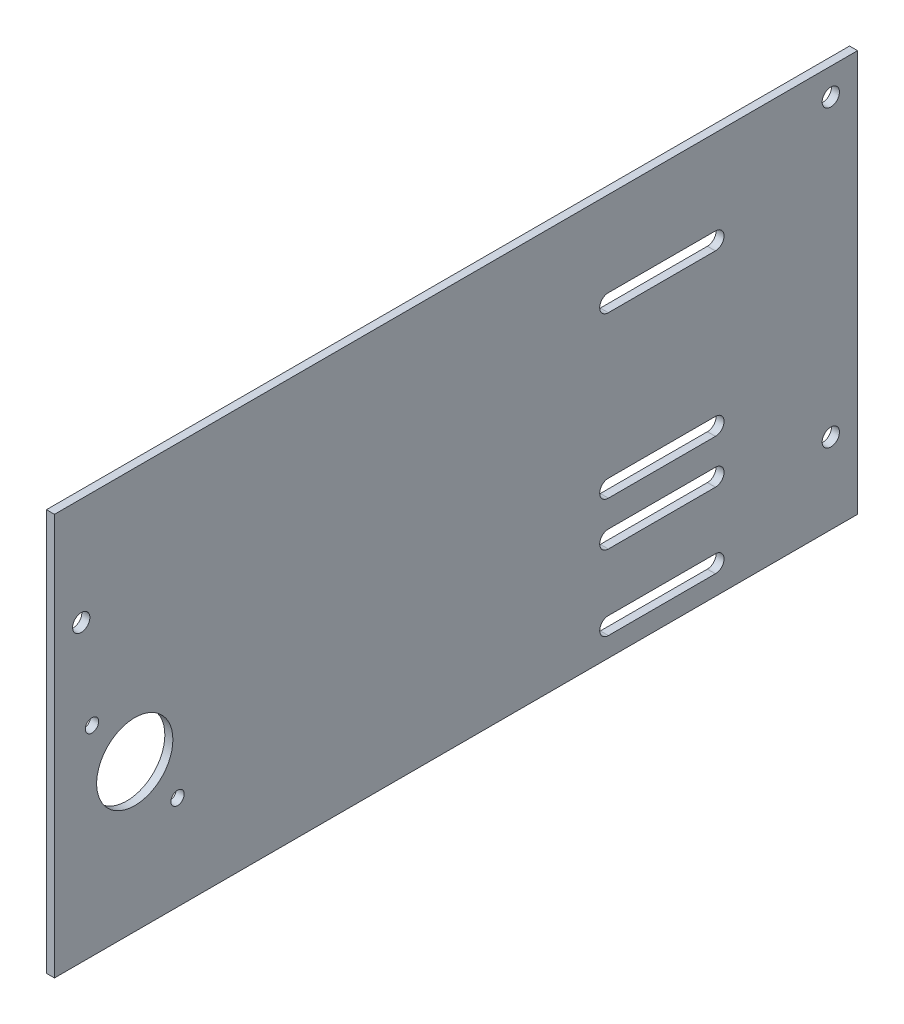
ISO-10303-21;
HEADER;
FILE_DESCRIPTION(('STEP AP214'),'2;1');
FILE_NAME('part.step','',(''),(''),'','','');
FILE_SCHEMA(('AUTOMOTIVE_DESIGN { 1 0 10303 214 1 1 1 1 }'));
ENDSEC;
DATA;
#1=APPLICATION_CONTEXT('core data for automotive mechanical design processes');
#2=APPLICATION_PROTOCOL_DEFINITION('international standard','automotive_design',2000,#1);
#3=PRODUCT_CONTEXT('',#1,'mechanical');
#4=PRODUCT('Part','Part','',(#3));
#5=PRODUCT_RELATED_PRODUCT_CATEGORY('part','',(#4));
#6=PRODUCT_DEFINITION_FORMATION('','',#4);
#7=PRODUCT_DEFINITION_CONTEXT('part definition',#1,'design');
#8=PRODUCT_DEFINITION('design','',#6,#7);
#9=PRODUCT_DEFINITION_SHAPE('','',#8);
#10=(LENGTH_UNIT() NAMED_UNIT(*) SI_UNIT(.MILLI.,.METRE.));
#11=(NAMED_UNIT(*) PLANE_ANGLE_UNIT() SI_UNIT($,.RADIAN.));
#12=(NAMED_UNIT(*) SI_UNIT($,.STERADIAN.) SOLID_ANGLE_UNIT());
#13=UNCERTAINTY_MEASURE_WITH_UNIT(LENGTH_MEASURE(1.E-05),#10,'distance_accuracy_value','');
#14=(GEOMETRIC_REPRESENTATION_CONTEXT(3) GLOBAL_UNCERTAINTY_ASSIGNED_CONTEXT((#13)) GLOBAL_UNIT_ASSIGNED_CONTEXT((#10,
#11,#12)) REPRESENTATION_CONTEXT('',''));
#15=CARTESIAN_POINT('',(0.,0.,0.));
#16=DIRECTION('',(0.,0.,1.));
#17=DIRECTION('',(1.,0.,0.));
#18=AXIS2_PLACEMENT_3D('',#15,#16,#17);
#19=CARTESIAN_POINT('',(3.,0.,0.));
#20=DIRECTION('',(-1.,0.,0.));
#21=DIRECTION('',(0.,0.,1.));
#22=AXIS2_PLACEMENT_3D('',#19,#20,#21);
#23=PLANE('',#22);
#24=CARTESIAN_POINT('',(3.,35.2682046198761,-45.9942568153991));
#25=DIRECTION('',(1.,0.,0.));
#26=DIRECTION('',(0.,0.,-1.));
#27=AXIS2_PLACEMENT_3D('',#24,#25,#26);
#28=CIRCLE('',#27,2.4892);
#29=CARTESIAN_POINT('',(3.,35.2682046198761,-48.4834568153991));
#30=VERTEX_POINT('',#29);
#31=EDGE_CURVE('E476',#30,#30,#28,.T.);
#32=ORIENTED_EDGE('',*,*,#31,.F.);
#33=EDGE_LOOP('',(#32));
#34=FACE_BOUND('',#33,.T.);
#35=CARTESIAN_POINT('',(3.,74.7317953801237,-14.0057431846019));
#36=DIRECTION('',(1.,0.,0.));
#37=DIRECTION('',(0.,0.,-1.));
#38=AXIS2_PLACEMENT_3D('',#35,#36,#37);
#39=CIRCLE('',#38,2.48920000000001);
#40=CARTESIAN_POINT('',(3.,74.7317953801237,-16.4949431846019));
#41=VERTEX_POINT('',#40);
#42=EDGE_CURVE('E479',#41,#41,#39,.T.);
#43=ORIENTED_EDGE('',*,*,#42,.F.);
#44=EDGE_LOOP('',(#43));
#45=FACE_BOUND('',#44,.T.);
#46=DIRECTION('',(0.,0.,1.));
#47=VECTOR('',#46,1.);
#48=CARTESIAN_POINT('',(3.,13.775,-246.901029004475));
#49=LINE('',#48,#47);
#50=CARTESIAN_POINT('',(3.,13.775,-246.901029004475));
#51=VERTEX_POINT('',#50);
#52=CARTESIAN_POINT('',(3.,13.775,-206.901029004475));
#53=VERTEX_POINT('',#52);
#54=EDGE_CURVE('E276',#51,#53,#49,.T.);
#55=ORIENTED_EDGE('',*,*,#54,.F.);
#56=CARTESIAN_POINT('',(3.,10.55,-246.901029004475));
#57=DIRECTION('',(-1.,0.,0.));
#58=DIRECTION('',(0.,0.,1.));
#59=AXIS2_PLACEMENT_3D('',#56,#57,#58);
#60=CIRCLE('',#59,3.225);
#61=CARTESIAN_POINT('',(3.,7.32499999999999,-246.901029004475));
#62=VERTEX_POINT('',#61);
#63=EDGE_CURVE('E274',#62,#51,#60,.F.);
#64=ORIENTED_EDGE('',*,*,#63,.F.);
#65=DIRECTION('',(0.,0.,-1.));
#66=VECTOR('',#65,1.);
#67=CARTESIAN_POINT('',(3.,7.32499999999999,-246.901029004475));
#68=LINE('',#67,#66);
#69=CARTESIAN_POINT('',(3.,7.325,-206.901029004475));
#70=VERTEX_POINT('',#69);
#71=EDGE_CURVE('E249',#70,#62,#68,.T.);
#72=ORIENTED_EDGE('',*,*,#71,.F.);
#73=CARTESIAN_POINT('',(3.,10.55,-206.901029004475));
#74=DIRECTION('',(-1.,0.,0.));
#75=DIRECTION('',(0.,0.,1.));
#76=AXIS2_PLACEMENT_3D('',#73,#74,#75);
#77=CIRCLE('',#76,3.225);
#78=EDGE_CURVE('E53',#53,#70,#77,.F.);
#79=ORIENTED_EDGE('',*,*,#78,.F.);
#80=EDGE_LOOP('',(#55,#64,#72,#79));
#81=FACE_BOUND('',#80,.T.);
#82=CARTESIAN_POINT('',(3.,30.,-290.));
#83=DIRECTION('',(-1.,0.,0.));
#84=DIRECTION('',(0.,0.,1.));
#85=AXIS2_PLACEMENT_3D('',#82,#83,#84);
#86=CIRCLE('',#85,3.22499999999999);
#87=CARTESIAN_POINT('',(3.,30.,-286.775));
#88=VERTEX_POINT('',#87);
#89=EDGE_CURVE('E242',#88,#88,#86,.F.);
#90=ORIENTED_EDGE('',*,*,#89,.F.);
#91=EDGE_LOOP('',(#90));
#92=FACE_BOUND('',#91,.T.);
#93=DIRECTION('',(0.,0.,-1.));
#94=VECTOR('',#93,1.);
#95=CARTESIAN_POINT('',(3.,111.77,-206.901029004475));
#96=LINE('',#95,#94);
#97=CARTESIAN_POINT('',(3.,111.77,-206.901029004475));
#98=VERTEX_POINT('',#97);
#99=CARTESIAN_POINT('',(3.,111.77,-246.901029004475));
#100=VERTEX_POINT('',#99);
#101=EDGE_CURVE('E231',#98,#100,#96,.T.);
#102=ORIENTED_EDGE('',*,*,#101,.F.);
#103=CARTESIAN_POINT('',(3.,115.,-206.901029004475));
#104=DIRECTION('',(-1.,0.,0.));
#105=DIRECTION('',(0.,0.,1.));
#106=AXIS2_PLACEMENT_3D('',#103,#104,#105);
#107=CIRCLE('',#106,3.22999999999996);
#108=CARTESIAN_POINT('',(3.,118.23,-206.901029004475));
#109=VERTEX_POINT('',#108);
#110=EDGE_CURVE('E229',#109,#98,#107,.F.);
#111=ORIENTED_EDGE('',*,*,#110,.F.);
#112=DIRECTION('',(0.,0.,1.));
#113=VECTOR('',#112,1.);
#114=CARTESIAN_POINT('',(3.,118.23,-206.901029004475));
#115=LINE('',#114,#113);
#116=CARTESIAN_POINT('',(3.,118.23,-246.901029004475));
#117=VERTEX_POINT('',#116);
#118=EDGE_CURVE('E207',#117,#109,#115,.T.);
#119=ORIENTED_EDGE('',*,*,#118,.F.);
#120=CARTESIAN_POINT('',(3.,115.,-246.901029004475));
#121=DIRECTION('',(-1.,0.,0.));
#122=DIRECTION('',(0.,0.,1.));
#123=AXIS2_PLACEMENT_3D('',#120,#121,#122);
#124=CIRCLE('',#123,3.22999999999996);
#125=EDGE_CURVE('E61',#100,#117,#124,.F.);
#126=ORIENTED_EDGE('',*,*,#125,.F.);
#127=EDGE_LOOP('',(#102,#111,#119,#126));
#128=FACE_BOUND('',#127,.T.);
#129=CARTESIAN_POINT('',(3.,140.,-290.));
#130=DIRECTION('',(-1.,0.,0.));
#131=DIRECTION('',(0.,0.,1.));
#132=AXIS2_PLACEMENT_3D('',#129,#130,#131);
#133=CIRCLE('',#132,3.22499999999999);
#134=CARTESIAN_POINT('',(3.,140.,-286.775));
#135=VERTEX_POINT('',#134);
#136=EDGE_CURVE('E238',#135,#135,#133,.F.);
#137=ORIENTED_EDGE('',*,*,#136,.F.);
#138=EDGE_LOOP('',(#137));
#139=FACE_BOUND('',#138,.T.);
#140=CARTESIAN_POINT('',(3.,110.,-10.));
#141=DIRECTION('',(-1.,0.,0.));
#142=DIRECTION('',(0.,0.,1.));
#143=AXIS2_PLACEMENT_3D('',#140,#141,#142);
#144=CIRCLE('',#143,3.225);
#145=CARTESIAN_POINT('',(3.,110.,-6.775));
#146=VERTEX_POINT('',#145);
#147=EDGE_CURVE('E205',#146,#146,#144,.F.);
#148=ORIENTED_EDGE('',*,*,#147,.F.);
#149=EDGE_LOOP('',(#148));
#150=FACE_BOUND('',#149,.T.);
#151=DIRECTION('',(0.,0.,1.));
#152=VECTOR('',#151,1.);
#153=CARTESIAN_POINT('',(3.,41.775,-246.901029004475));
#154=LINE('',#153,#152);
#155=CARTESIAN_POINT('',(3.,41.775,-246.901029004475));
#156=VERTEX_POINT('',#155);
#157=CARTESIAN_POINT('',(3.,41.775,-206.901029004475));
#158=VERTEX_POINT('',#157);
#159=EDGE_CURVE('E179',#156,#158,#154,.T.);
#160=ORIENTED_EDGE('',*,*,#159,.F.);
#161=CARTESIAN_POINT('',(3.,38.55,-246.901029004475));
#162=DIRECTION('',(-1.,0.,0.));
#163=DIRECTION('',(0.,0.,1.));
#164=AXIS2_PLACEMENT_3D('',#161,#162,#163);
#165=CIRCLE('',#164,3.22500000000001);
#166=CARTESIAN_POINT('',(3.,35.325,-246.901029004475));
#167=VERTEX_POINT('',#166);
#168=EDGE_CURVE('E188',#167,#156,#165,.F.);
#169=ORIENTED_EDGE('',*,*,#168,.F.);
#170=DIRECTION('',(0.,0.,-1.));
#171=VECTOR('',#170,1.);
#172=CARTESIAN_POINT('',(3.,35.325,-246.901029004475));
#173=LINE('',#172,#171);
#174=CARTESIAN_POINT('',(3.,35.325,-206.901029004475));
#175=VERTEX_POINT('',#174);
#176=EDGE_CURVE('E190',#175,#167,#173,.T.);
#177=ORIENTED_EDGE('',*,*,#176,.F.);
#178=CARTESIAN_POINT('',(3.,38.55,-206.901029004475));
#179=DIRECTION('',(-1.,0.,0.));
#180=DIRECTION('',(0.,0.,1.));
#181=AXIS2_PLACEMENT_3D('',#178,#179,#180);
#182=CIRCLE('',#181,3.22500000000001);
#183=EDGE_CURVE('E197',#158,#175,#182,.F.);
#184=ORIENTED_EDGE('',*,*,#183,.F.);
#185=EDGE_LOOP('',(#160,#169,#177,#184));
#186=FACE_BOUND('',#185,.T.);
#187=DIRECTION('',(0.,0.,1.));
#188=VECTOR('',#187,1.);
#189=CARTESIAN_POINT('',(3.,58.225,-246.901029004475));
#190=LINE('',#189,#188);
#191=CARTESIAN_POINT('',(3.,58.225,-246.901029004475));
#192=VERTEX_POINT('',#191);
#193=CARTESIAN_POINT('',(3.,58.225,-206.901029004475));
#194=VERTEX_POINT('',#193);
#195=EDGE_CURVE('E285',#192,#194,#190,.T.);
#196=ORIENTED_EDGE('',*,*,#195,.F.);
#197=CARTESIAN_POINT('',(3.,55.,-246.901029004475));
#198=DIRECTION('',(-1.,0.,0.));
#199=DIRECTION('',(0.,0.,1.));
#200=AXIS2_PLACEMENT_3D('',#197,#198,#199);
#201=CIRCLE('',#200,3.22500000000001);
#202=CARTESIAN_POINT('',(3.,51.775,-246.901029004475));
#203=VERTEX_POINT('',#202);
#204=EDGE_CURVE('E282',#203,#192,#201,.F.);
#205=ORIENTED_EDGE('',*,*,#204,.F.);
#206=DIRECTION('',(0.,0.,-1.));
#207=VECTOR('',#206,1.);
#208=CARTESIAN_POINT('',(3.,51.775,-246.901029004475));
#209=LINE('',#208,#207);
#210=CARTESIAN_POINT('',(3.,51.775,-206.901029004475));
#211=VERTEX_POINT('',#210);
#212=EDGE_CURVE('E305',#211,#203,#209,.T.);
#213=ORIENTED_EDGE('',*,*,#212,.F.);
#214=CARTESIAN_POINT('',(3.,55.,-206.901029004475));
#215=DIRECTION('',(-1.,0.,0.));
#216=DIRECTION('',(0.,0.,1.));
#217=AXIS2_PLACEMENT_3D('',#214,#215,#216);
#218=CIRCLE('',#217,3.225);
#219=EDGE_CURVE('E240',#194,#211,#218,.F.);
#220=ORIENTED_EDGE('',*,*,#219,.F.);
#221=EDGE_LOOP('',(#196,#205,#213,#220));
#222=FACE_BOUND('',#221,.T.);
#223=DIRECTION('',(0.,-1.,0.));
#224=VECTOR('',#223,1.);
#225=CARTESIAN_POINT('',(3.,0.,0.));
#226=LINE('',#225,#224);
#227=CARTESIAN_POINT('',(3.,150.,0.));
#228=VERTEX_POINT('',#227);
#229=CARTESIAN_POINT('',(3.,0.,0.));
#230=VERTEX_POINT('',#229);
#231=EDGE_CURVE('E319',#228,#230,#226,.T.);
#232=ORIENTED_EDGE('',*,*,#231,.T.);
#233=DIRECTION('',(0.,0.,-1.));
#234=VECTOR('',#233,1.);
#235=CARTESIAN_POINT('',(3.,0.,0.));
#236=LINE('',#235,#234);
#237=CARTESIAN_POINT('',(3.,0.,-300.));
#238=VERTEX_POINT('',#237);
#239=EDGE_CURVE('E324',#230,#238,#236,.T.);
#240=ORIENTED_EDGE('',*,*,#239,.T.);
#241=DIRECTION('',(0.,1.,0.));
#242=VECTOR('',#241,1.);
#243=CARTESIAN_POINT('',(3.,0.,-300.));
#244=LINE('',#243,#242);
#245=CARTESIAN_POINT('',(3.,150.,-300.));
#246=VERTEX_POINT('',#245);
#247=EDGE_CURVE('E323',#238,#246,#244,.T.);
#248=ORIENTED_EDGE('',*,*,#247,.T.);
#249=DIRECTION('',(0.,0.,1.));
#250=VECTOR('',#249,1.);
#251=CARTESIAN_POINT('',(3.,150.,0.));
#252=LINE('',#251,#250);
#253=EDGE_CURVE('E328',#246,#228,#252,.T.);
#254=ORIENTED_EDGE('',*,*,#253,.T.);
#255=EDGE_LOOP('',(#232,#240,#248,#254));
#256=FACE_BOUND('',#255,.T.);
#257=CARTESIAN_POINT('',(3.,55.,-30.));
#258=DIRECTION('',(1.,0.,0.));
#259=DIRECTION('',(0.,0.,-1.));
#260=AXIS2_PLACEMENT_3D('',#257,#258,#259);
#261=CIRCLE('',#260,14.235);
#262=CARTESIAN_POINT('',(3.,55.,-44.235));
#263=VERTEX_POINT('',#262);
#264=EDGE_CURVE('E315',#263,#263,#261,.T.);
#265=ORIENTED_EDGE('',*,*,#264,.F.);
#266=EDGE_LOOP('',(#265));
#267=FACE_BOUND('',#266,.T.);
#268=ADVANCED_FACE('F39',(#34,#45,#81,#92,#128,#139,#150,#186,#222,#256,#267),#23,.F.);
#269=CARTESIAN_POINT('',(0.,0.,0.));
#270=DIRECTION('',(-1.,0.,0.));
#271=DIRECTION('',(0.,0.,1.));
#272=AXIS2_PLACEMENT_3D('',#269,#270,#271);
#273=PLANE('',#272);
#274=CARTESIAN_POINT('',(0.,35.2682046198761,-45.9942568153991));
#275=DIRECTION('',(1.,0.,0.));
#276=DIRECTION('',(0.,0.,-1.));
#277=AXIS2_PLACEMENT_3D('',#274,#275,#276);
#278=CIRCLE('',#277,2.4892);
#279=CARTESIAN_POINT('',(0.,35.2682046198761,-48.4834568153991));
#280=VERTEX_POINT('',#279);
#281=EDGE_CURVE('E251',#280,#280,#278,.T.);
#282=ORIENTED_EDGE('',*,*,#281,.T.);
#283=EDGE_LOOP('',(#282));
#284=FACE_BOUND('',#283,.T.);
#285=CARTESIAN_POINT('',(0.,74.7317953801237,-14.0057431846019));
#286=DIRECTION('',(1.,0.,0.));
#287=DIRECTION('',(0.,0.,-1.));
#288=AXIS2_PLACEMENT_3D('',#285,#286,#287);
#289=CIRCLE('',#288,2.48920000000001);
#290=CARTESIAN_POINT('',(0.,74.7317953801237,-16.4949431846019));
#291=VERTEX_POINT('',#290);
#292=EDGE_CURVE('E481',#291,#291,#289,.T.);
#293=ORIENTED_EDGE('',*,*,#292,.T.);
#294=EDGE_LOOP('',(#293));
#295=FACE_BOUND('',#294,.T.);
#296=CARTESIAN_POINT('',(0.,10.55,-246.901029004475));
#297=DIRECTION('',(-1.,0.,0.));
#298=DIRECTION('',(0.,0.,1.));
#299=AXIS2_PLACEMENT_3D('',#296,#297,#298);
#300=CIRCLE('',#299,3.225);
#301=CARTESIAN_POINT('',(0.,13.775,-246.901029004475));
#302=VERTEX_POINT('',#301);
#303=CARTESIAN_POINT('',(0.,7.32499999999999,-246.901029004475));
#304=VERTEX_POINT('',#303);
#305=EDGE_CURVE('E275',#302,#304,#300,.T.);
#306=ORIENTED_EDGE('',*,*,#305,.F.);
#307=DIRECTION('',(0.,0.,-1.));
#308=VECTOR('',#307,1.);
#309=CARTESIAN_POINT('',(0.,13.775,-246.901029004475));
#310=LINE('',#309,#308);
#311=CARTESIAN_POINT('',(0.,13.775,-206.901029004475));
#312=VERTEX_POINT('',#311);
#313=EDGE_CURVE('E260',#312,#302,#310,.T.);
#314=ORIENTED_EDGE('',*,*,#313,.F.);
#315=CARTESIAN_POINT('',(0.,10.55,-206.901029004475));
#316=DIRECTION('',(-1.,0.,0.));
#317=DIRECTION('',(0.,0.,1.));
#318=AXIS2_PLACEMENT_3D('',#315,#316,#317);
#319=CIRCLE('',#318,3.225);
#320=CARTESIAN_POINT('',(0.,7.325,-206.901029004475));
#321=VERTEX_POINT('',#320);
#322=EDGE_CURVE('E268',#321,#312,#319,.T.);
#323=ORIENTED_EDGE('',*,*,#322,.F.);
#324=DIRECTION('',(0.,0.,1.));
#325=VECTOR('',#324,1.);
#326=CARTESIAN_POINT('',(0.,7.32499999999999,-246.901029004475));
#327=LINE('',#326,#325);
#328=EDGE_CURVE('E267',#304,#321,#327,.T.);
#329=ORIENTED_EDGE('',*,*,#328,.F.);
#330=EDGE_LOOP('',(#306,#314,#323,#329));
#331=FACE_BOUND('',#330,.T.);
#332=CARTESIAN_POINT('',(0.,30.,-290.));
#333=DIRECTION('',(-1.,0.,0.));
#334=DIRECTION('',(0.,0.,1.));
#335=AXIS2_PLACEMENT_3D('',#332,#333,#334);
#336=CIRCLE('',#335,3.22499999999999);
#337=CARTESIAN_POINT('',(0.,30.,-286.775));
#338=VERTEX_POINT('',#337);
#339=EDGE_CURVE('E250',#338,#338,#336,.T.);
#340=ORIENTED_EDGE('',*,*,#339,.F.);
#341=EDGE_LOOP('',(#340));
#342=FACE_BOUND('',#341,.T.);
#343=CARTESIAN_POINT('',(0.,115.,-206.901029004475));
#344=DIRECTION('',(-1.,0.,0.));
#345=DIRECTION('',(0.,0.,1.));
#346=AXIS2_PLACEMENT_3D('',#343,#344,#345);
#347=CIRCLE('',#346,3.22999999999996);
#348=CARTESIAN_POINT('',(0.,111.77,-206.901029004475));
#349=VERTEX_POINT('',#348);
#350=CARTESIAN_POINT('',(0.,118.23,-206.901029004475));
#351=VERTEX_POINT('',#350);
#352=EDGE_CURVE('E226',#349,#351,#347,.T.);
#353=ORIENTED_EDGE('',*,*,#352,.F.);
#354=DIRECTION('',(0.,0.,1.));
#355=VECTOR('',#354,1.);
#356=CARTESIAN_POINT('',(0.,111.77,-206.901029004475));
#357=LINE('',#356,#355);
#358=CARTESIAN_POINT('',(0.,111.77,-246.901029004475));
#359=VERTEX_POINT('',#358);
#360=EDGE_CURVE('E213',#359,#349,#357,.T.);
#361=ORIENTED_EDGE('',*,*,#360,.F.);
#362=CARTESIAN_POINT('',(0.,115.,-246.901029004475));
#363=DIRECTION('',(-1.,0.,0.));
#364=DIRECTION('',(0.,0.,1.));
#365=AXIS2_PLACEMENT_3D('',#362,#363,#364);
#366=CIRCLE('',#365,3.22999999999996);
#367=CARTESIAN_POINT('',(0.,118.23,-246.901029004475));
#368=VERTEX_POINT('',#367);
#369=EDGE_CURVE('E225',#368,#359,#366,.T.);
#370=ORIENTED_EDGE('',*,*,#369,.F.);
#371=DIRECTION('',(0.,0.,-1.));
#372=VECTOR('',#371,1.);
#373=CARTESIAN_POINT('',(0.,118.23,-206.901029004475));
#374=LINE('',#373,#372);
#375=EDGE_CURVE('E224',#351,#368,#374,.T.);
#376=ORIENTED_EDGE('',*,*,#375,.F.);
#377=EDGE_LOOP('',(#353,#361,#370,#376));
#378=FACE_BOUND('',#377,.T.);
#379=CARTESIAN_POINT('',(0.,140.,-290.));
#380=DIRECTION('',(-1.,0.,0.));
#381=DIRECTION('',(0.,0.,1.));
#382=AXIS2_PLACEMENT_3D('',#379,#380,#381);
#383=CIRCLE('',#382,3.22499999999999);
#384=CARTESIAN_POINT('',(0.,140.,-286.775));
#385=VERTEX_POINT('',#384);
#386=EDGE_CURVE('E208',#385,#385,#383,.T.);
#387=ORIENTED_EDGE('',*,*,#386,.F.);
#388=EDGE_LOOP('',(#387));
#389=FACE_BOUND('',#388,.T.);
#390=CARTESIAN_POINT('',(0.,110.,-10.));
#391=DIRECTION('',(-1.,0.,0.));
#392=DIRECTION('',(0.,0.,1.));
#393=AXIS2_PLACEMENT_3D('',#390,#391,#392);
#394=CIRCLE('',#393,3.225);
#395=CARTESIAN_POINT('',(0.,110.,-6.775));
#396=VERTEX_POINT('',#395);
#397=EDGE_CURVE('E241',#396,#396,#394,.T.);
#398=ORIENTED_EDGE('',*,*,#397,.F.);
#399=EDGE_LOOP('',(#398));
#400=FACE_BOUND('',#399,.T.);
#401=CARTESIAN_POINT('',(0.,38.55,-246.901029004475));
#402=DIRECTION('',(-1.,0.,0.));
#403=DIRECTION('',(0.,0.,1.));
#404=AXIS2_PLACEMENT_3D('',#401,#402,#403);
#405=CIRCLE('',#404,3.22500000000001);
#406=CARTESIAN_POINT('',(0.,41.775,-246.901029004475));
#407=VERTEX_POINT('',#406);
#408=CARTESIAN_POINT('',(0.,35.325,-246.901029004475));
#409=VERTEX_POINT('',#408);
#410=EDGE_CURVE('E200',#407,#409,#405,.T.);
#411=ORIENTED_EDGE('',*,*,#410,.F.);
#412=DIRECTION('',(0.,0.,-1.));
#413=VECTOR('',#412,1.);
#414=CARTESIAN_POINT('',(0.,41.775,-246.901029004475));
#415=LINE('',#414,#413);
#416=CARTESIAN_POINT('',(0.,41.775,-206.901029004475));
#417=VERTEX_POINT('',#416);
#418=EDGE_CURVE('E182',#417,#407,#415,.T.);
#419=ORIENTED_EDGE('',*,*,#418,.F.);
#420=CARTESIAN_POINT('',(0.,38.55,-206.901029004475));
#421=DIRECTION('',(-1.,0.,0.));
#422=DIRECTION('',(0.,0.,1.));
#423=AXIS2_PLACEMENT_3D('',#420,#421,#422);
#424=CIRCLE('',#423,3.22500000000001);
#425=CARTESIAN_POINT('',(0.,35.325,-206.901029004475));
#426=VERTEX_POINT('',#425);
#427=EDGE_CURVE('E498',#426,#417,#424,.T.);
#428=ORIENTED_EDGE('',*,*,#427,.F.);
#429=DIRECTION('',(0.,0.,1.));
#430=VECTOR('',#429,1.);
#431=CARTESIAN_POINT('',(0.,35.325,-246.901029004475));
#432=LINE('',#431,#430);
#433=EDGE_CURVE('E501',#409,#426,#432,.T.);
#434=ORIENTED_EDGE('',*,*,#433,.F.);
#435=EDGE_LOOP('',(#411,#419,#428,#434));
#436=FACE_BOUND('',#435,.T.);
#437=CARTESIAN_POINT('',(0.,55.,-246.901029004475));
#438=DIRECTION('',(-1.,0.,0.));
#439=DIRECTION('',(0.,0.,1.));
#440=AXIS2_PLACEMENT_3D('',#437,#438,#439);
#441=CIRCLE('',#440,3.22500000000001);
#442=CARTESIAN_POINT('',(0.,58.225,-246.901029004475));
#443=VERTEX_POINT('',#442);
#444=CARTESIAN_POINT('',(0.,51.775,-246.901029004475));
#445=VERTEX_POINT('',#444);
#446=EDGE_CURVE('E286',#443,#445,#441,.T.);
#447=ORIENTED_EDGE('',*,*,#446,.F.);
#448=DIRECTION('',(0.,0.,-1.));
#449=VECTOR('',#448,1.);
#450=CARTESIAN_POINT('',(0.,58.225,-246.901029004475));
#451=LINE('',#450,#449);
#452=CARTESIAN_POINT('',(0.,58.225,-206.901029004475));
#453=VERTEX_POINT('',#452);
#454=EDGE_CURVE('E298',#453,#443,#451,.T.);
#455=ORIENTED_EDGE('',*,*,#454,.F.);
#456=CARTESIAN_POINT('',(0.,55.,-206.901029004475));
#457=DIRECTION('',(-1.,0.,0.));
#458=DIRECTION('',(0.,0.,1.));
#459=AXIS2_PLACEMENT_3D('',#456,#457,#458);
#460=CIRCLE('',#459,3.225);
#461=CARTESIAN_POINT('',(0.,51.775,-206.901029004475));
#462=VERTEX_POINT('',#461);
#463=EDGE_CURVE('E291',#462,#453,#460,.T.);
#464=ORIENTED_EDGE('',*,*,#463,.F.);
#465=DIRECTION('',(0.,0.,1.));
#466=VECTOR('',#465,1.);
#467=CARTESIAN_POINT('',(0.,51.775,-246.901029004475));
#468=LINE('',#467,#466);
#469=EDGE_CURVE('E289',#445,#462,#468,.T.);
#470=ORIENTED_EDGE('',*,*,#469,.F.);
#471=EDGE_LOOP('',(#447,#455,#464,#470));
#472=FACE_BOUND('',#471,.T.);
#473=DIRECTION('',(0.,-1.,0.));
#474=VECTOR('',#473,1.);
#475=CARTESIAN_POINT('',(0.,0.,0.));
#476=LINE('',#475,#474);
#477=CARTESIAN_POINT('',(0.,150.,0.));
#478=VERTEX_POINT('',#477);
#479=CARTESIAN_POINT('',(0.,0.,0.));
#480=VERTEX_POINT('',#479);
#481=EDGE_CURVE('E314',#478,#480,#476,.T.);
#482=ORIENTED_EDGE('',*,*,#481,.F.);
#483=DIRECTION('',(0.,0.,1.));
#484=VECTOR('',#483,1.);
#485=CARTESIAN_POINT('',(0.,150.,0.));
#486=LINE('',#485,#484);
#487=CARTESIAN_POINT('',(0.,150.,-300.));
#488=VERTEX_POINT('',#487);
#489=EDGE_CURVE('E321',#488,#478,#486,.T.);
#490=ORIENTED_EDGE('',*,*,#489,.F.);
#491=DIRECTION('',(0.,1.,0.));
#492=VECTOR('',#491,1.);
#493=CARTESIAN_POINT('',(0.,0.,-300.));
#494=LINE('',#493,#492);
#495=CARTESIAN_POINT('',(0.,0.,-300.));
#496=VERTEX_POINT('',#495);
#497=EDGE_CURVE('E331',#496,#488,#494,.T.);
#498=ORIENTED_EDGE('',*,*,#497,.F.);
#499=DIRECTION('',(0.,0.,-1.));
#500=VECTOR('',#499,1.);
#501=CARTESIAN_POINT('',(0.,0.,0.));
#502=LINE('',#501,#500);
#503=EDGE_CURVE('E333',#480,#496,#502,.T.);
#504=ORIENTED_EDGE('',*,*,#503,.F.);
#505=EDGE_LOOP('',(#482,#490,#498,#504));
#506=FACE_BOUND('',#505,.T.);
#507=CARTESIAN_POINT('',(0.,55.,-30.));
#508=DIRECTION('',(1.,0.,0.));
#509=DIRECTION('',(0.,0.,-1.));
#510=AXIS2_PLACEMENT_3D('',#507,#508,#509);
#511=CIRCLE('',#510,14.235);
#512=CARTESIAN_POINT('',(0.,55.,-44.235));
#513=VERTEX_POINT('',#512);
#514=EDGE_CURVE('E311',#513,#513,#511,.T.);
#515=ORIENTED_EDGE('',*,*,#514,.T.);
#516=EDGE_LOOP('',(#515));
#517=FACE_BOUND('',#516,.T.);
#518=ADVANCED_FACE('F353',(#284,#295,#331,#342,#378,#389,#400,#436,#472,#506,#517),#273,.T.);
#519=CARTESIAN_POINT('',(3.,0.,0.));
#520=DIRECTION('',(0.,0.,-1.));
#521=DIRECTION('',(-1.,0.,0.));
#522=AXIS2_PLACEMENT_3D('',#519,#520,#521);
#523=PLANE('',#522);
#524=ORIENTED_EDGE('',*,*,#481,.T.);
#525=DIRECTION('',(-1.,0.,0.));
#526=VECTOR('',#525,1.);
#527=CARTESIAN_POINT('',(3.,0.,0.));
#528=LINE('',#527,#526);
#529=EDGE_CURVE('E11',#230,#480,#528,.T.);
#530=ORIENTED_EDGE('',*,*,#529,.F.);
#531=ORIENTED_EDGE('',*,*,#231,.F.);
#532=DIRECTION('',(-1.,0.,0.));
#533=VECTOR('',#532,1.);
#534=CARTESIAN_POINT('',(3.,150.,0.));
#535=LINE('',#534,#533);
#536=EDGE_CURVE('E326',#228,#478,#535,.T.);
#537=ORIENTED_EDGE('',*,*,#536,.T.);
#538=EDGE_LOOP('',(#524,#530,#531,#537));
#539=FACE_BOUND('',#538,.T.);
#540=ADVANCED_FACE('F41',(#539),#523,.F.);
#541=CARTESIAN_POINT('',(3.,0.,0.));
#542=DIRECTION('',(0.,1.,0.));
#543=DIRECTION('',(0.,0.,1.));
#544=AXIS2_PLACEMENT_3D('',#541,#542,#543);
#545=PLANE('',#544);
#546=ORIENTED_EDGE('',*,*,#503,.T.);
#547=DIRECTION('',(-1.,0.,0.));
#548=VECTOR('',#547,1.);
#549=CARTESIAN_POINT('',(3.,0.,-300.));
#550=LINE('',#549,#548);
#551=EDGE_CURVE('E50',#238,#496,#550,.T.);
#552=ORIENTED_EDGE('',*,*,#551,.F.);
#553=ORIENTED_EDGE('',*,*,#239,.F.);
#554=ORIENTED_EDGE('',*,*,#529,.T.);
#555=EDGE_LOOP('',(#546,#552,#553,#554));
#556=FACE_BOUND('',#555,.T.);
#557=ADVANCED_FACE('F365',(#556),#545,.F.);
#558=CARTESIAN_POINT('',(3.,0.,-300.));
#559=DIRECTION('',(0.,0.,1.));
#560=DIRECTION('',(1.,0.,0.));
#561=AXIS2_PLACEMENT_3D('',#558,#559,#560);
#562=PLANE('',#561);
#563=ORIENTED_EDGE('',*,*,#497,.T.);
#564=DIRECTION('',(-1.,0.,0.));
#565=VECTOR('',#564,1.);
#566=CARTESIAN_POINT('',(3.,150.,-300.));
#567=LINE('',#566,#565);
#568=EDGE_CURVE('E336',#246,#488,#567,.T.);
#569=ORIENTED_EDGE('',*,*,#568,.F.);
#570=ORIENTED_EDGE('',*,*,#247,.F.);
#571=ORIENTED_EDGE('',*,*,#551,.T.);
#572=EDGE_LOOP('',(#563,#569,#570,#571));
#573=FACE_BOUND('',#572,.T.);
#574=ADVANCED_FACE('F342',(#573),#562,.F.);
#575=CARTESIAN_POINT('',(3.,150.,0.));
#576=DIRECTION('',(0.,-1.,0.));
#577=DIRECTION('',(0.,0.,-1.));
#578=AXIS2_PLACEMENT_3D('',#575,#576,#577);
#579=PLANE('',#578);
#580=ORIENTED_EDGE('',*,*,#489,.T.);
#581=ORIENTED_EDGE('',*,*,#536,.F.);
#582=ORIENTED_EDGE('',*,*,#253,.F.);
#583=ORIENTED_EDGE('',*,*,#568,.T.);
#584=EDGE_LOOP('',(#580,#581,#582,#583));
#585=FACE_BOUND('',#584,.T.);
#586=ADVANCED_FACE('F354',(#585),#579,.F.);
#587=CARTESIAN_POINT('',(3.,55.,-30.));
#588=DIRECTION('',(-1.,0.,0.));
#589=DIRECTION('',(0.,0.,1.));
#590=AXIS2_PLACEMENT_3D('',#587,#588,#589);
#591=CYLINDRICAL_SURFACE('',#590,14.235);
#592=ORIENTED_EDGE('',*,*,#264,.T.);
#593=EDGE_LOOP('',(#592));
#594=FACE_BOUND('',#593,.T.);
#595=ORIENTED_EDGE('',*,*,#514,.F.);
#596=EDGE_LOOP('',(#595));
#597=FACE_BOUND('',#596,.T.);
#598=ADVANCED_FACE('F382',(#594,#597),#591,.F.);
#599=CARTESIAN_POINT('',(3.001,55.,-246.901029004475));
#600=DIRECTION('',(-1.,0.,0.));
#601=DIRECTION('',(0.,0.,1.));
#602=AXIS2_PLACEMENT_3D('',#599,#600,#601);
#603=CYLINDRICAL_SURFACE('',#602,3.22500000000001);
#604=ORIENTED_EDGE('',*,*,#204,.T.);
#605=DIRECTION('',(-1.,0.,0.));
#606=VECTOR('',#605,1.);
#607=CARTESIAN_POINT('',(3.001,58.225,-246.901029004475));
#608=LINE('',#607,#606);
#609=EDGE_CURVE('E297',#192,#443,#608,.T.);
#610=ORIENTED_EDGE('',*,*,#609,.T.);
#611=ORIENTED_EDGE('',*,*,#446,.T.);
#612=DIRECTION('',(-1.,0.,0.));
#613=VECTOR('',#612,1.);
#614=CARTESIAN_POINT('',(3.001,51.775,-246.901029004475));
#615=LINE('',#614,#613);
#616=EDGE_CURVE('E299',#203,#445,#615,.T.);
#617=ORIENTED_EDGE('',*,*,#616,.F.);
#618=EDGE_LOOP('',(#604,#610,#611,#617));
#619=FACE_BOUND('',#618,.T.);
#620=ADVANCED_FACE('F390',(#619),#603,.F.);
#621=CARTESIAN_POINT('',(3.001,58.225,-246.901029004475));
#622=DIRECTION('',(0.,1.,0.));
#623=DIRECTION('',(0.,0.,1.));
#624=AXIS2_PLACEMENT_3D('',#621,#622,#623);
#625=PLANE('',#624);
#626=ORIENTED_EDGE('',*,*,#195,.T.);
#627=DIRECTION('',(-1.,0.,0.));
#628=VECTOR('',#627,1.);
#629=CARTESIAN_POINT('',(3.001,58.225,-206.901029004475));
#630=LINE('',#629,#628);
#631=EDGE_CURVE('E303',#194,#453,#630,.T.);
#632=ORIENTED_EDGE('',*,*,#631,.T.);
#633=ORIENTED_EDGE('',*,*,#454,.T.);
#634=ORIENTED_EDGE('',*,*,#609,.F.);
#635=EDGE_LOOP('',(#626,#632,#633,#634));
#636=FACE_BOUND('',#635,.T.);
#637=ADVANCED_FACE('F391',(#636),#625,.F.);
#638=CARTESIAN_POINT('',(3.001,55.,-206.901029004475));
#639=DIRECTION('',(-1.,0.,0.));
#640=DIRECTION('',(0.,0.,1.));
#641=AXIS2_PLACEMENT_3D('',#638,#639,#640);
#642=CYLINDRICAL_SURFACE('',#641,3.225);
#643=ORIENTED_EDGE('',*,*,#219,.T.);
#644=DIRECTION('',(-1.,0.,0.));
#645=VECTOR('',#644,1.);
#646=CARTESIAN_POINT('',(3.001,51.775,-206.901029004475));
#647=LINE('',#646,#645);
#648=EDGE_CURVE('E304',#211,#462,#647,.T.);
#649=ORIENTED_EDGE('',*,*,#648,.T.);
#650=ORIENTED_EDGE('',*,*,#463,.T.);
#651=ORIENTED_EDGE('',*,*,#631,.F.);
#652=EDGE_LOOP('',(#643,#649,#650,#651));
#653=FACE_BOUND('',#652,.T.);
#654=ADVANCED_FACE('F402',(#653),#642,.F.);
#655=CARTESIAN_POINT('',(3.001,51.775,-246.901029004475));
#656=DIRECTION('',(0.,-1.,0.));
#657=DIRECTION('',(0.,0.,-1.));
#658=AXIS2_PLACEMENT_3D('',#655,#656,#657);
#659=PLANE('',#658);
#660=ORIENTED_EDGE('',*,*,#212,.T.);
#661=ORIENTED_EDGE('',*,*,#616,.T.);
#662=ORIENTED_EDGE('',*,*,#469,.T.);
#663=ORIENTED_EDGE('',*,*,#648,.F.);
#664=EDGE_LOOP('',(#660,#661,#662,#663));
#665=FACE_BOUND('',#664,.T.);
#666=ADVANCED_FACE('F403',(#665),#659,.F.);
#667=CARTESIAN_POINT('',(3.001,38.55,-246.901029004475));
#668=DIRECTION('',(-1.,0.,0.));
#669=DIRECTION('',(0.,0.,1.));
#670=AXIS2_PLACEMENT_3D('',#667,#668,#669);
#671=CYLINDRICAL_SURFACE('',#670,3.22500000000001);
#672=ORIENTED_EDGE('',*,*,#168,.T.);
#673=DIRECTION('',(-1.,0.,0.));
#674=VECTOR('',#673,1.);
#675=CARTESIAN_POINT('',(3.001,41.775,-246.901029004475));
#676=LINE('',#675,#674);
#677=EDGE_CURVE('E176',#156,#407,#676,.T.);
#678=ORIENTED_EDGE('',*,*,#677,.T.);
#679=ORIENTED_EDGE('',*,*,#410,.T.);
#680=DIRECTION('',(-1.,0.,0.));
#681=VECTOR('',#680,1.);
#682=CARTESIAN_POINT('',(3.001,35.325,-246.901029004475));
#683=LINE('',#682,#681);
#684=EDGE_CURVE('E195',#167,#409,#683,.T.);
#685=ORIENTED_EDGE('',*,*,#684,.F.);
#686=EDGE_LOOP('',(#672,#678,#679,#685));
#687=FACE_BOUND('',#686,.T.);
#688=ADVANCED_FACE('F194',(#687),#671,.F.);
#689=CARTESIAN_POINT('',(3.001,41.775,-246.901029004475));
#690=DIRECTION('',(0.,1.,0.));
#691=DIRECTION('',(0.,0.,1.));
#692=AXIS2_PLACEMENT_3D('',#689,#690,#691);
#693=PLANE('',#692);
#694=ORIENTED_EDGE('',*,*,#159,.T.);
#695=DIRECTION('',(-1.,0.,0.));
#696=VECTOR('',#695,1.);
#697=CARTESIAN_POINT('',(3.001,41.775,-206.901029004475));
#698=LINE('',#697,#696);
#699=EDGE_CURVE('E187',#158,#417,#698,.T.);
#700=ORIENTED_EDGE('',*,*,#699,.T.);
#701=ORIENTED_EDGE('',*,*,#418,.T.);
#702=ORIENTED_EDGE('',*,*,#677,.F.);
#703=EDGE_LOOP('',(#694,#700,#701,#702));
#704=FACE_BOUND('',#703,.T.);
#705=ADVANCED_FACE('F178',(#704),#693,.F.);
#706=CARTESIAN_POINT('',(3.001,38.55,-206.901029004475));
#707=DIRECTION('',(-1.,0.,0.));
#708=DIRECTION('',(0.,0.,1.));
#709=AXIS2_PLACEMENT_3D('',#706,#707,#708);
#710=CYLINDRICAL_SURFACE('',#709,3.22500000000001);
#711=ORIENTED_EDGE('',*,*,#183,.T.);
#712=DIRECTION('',(-1.,0.,0.));
#713=VECTOR('',#712,1.);
#714=CARTESIAN_POINT('',(3.001,35.325,-206.901029004475));
#715=LINE('',#714,#713);
#716=EDGE_CURVE('E494',#175,#426,#715,.T.);
#717=ORIENTED_EDGE('',*,*,#716,.T.);
#718=ORIENTED_EDGE('',*,*,#427,.T.);
#719=ORIENTED_EDGE('',*,*,#699,.F.);
#720=EDGE_LOOP('',(#711,#717,#718,#719));
#721=FACE_BOUND('',#720,.T.);
#722=ADVANCED_FACE('F455',(#721),#710,.F.);
#723=CARTESIAN_POINT('',(3.001,35.325,-246.901029004475));
#724=DIRECTION('',(0.,-1.,0.));
#725=DIRECTION('',(0.,0.,-1.));
#726=AXIS2_PLACEMENT_3D('',#723,#724,#725);
#727=PLANE('',#726);
#728=ORIENTED_EDGE('',*,*,#176,.T.);
#729=ORIENTED_EDGE('',*,*,#684,.T.);
#730=ORIENTED_EDGE('',*,*,#433,.T.);
#731=ORIENTED_EDGE('',*,*,#716,.F.);
#732=EDGE_LOOP('',(#728,#729,#730,#731));
#733=FACE_BOUND('',#732,.T.);
#734=ADVANCED_FACE('F458',(#733),#727,.F.);
#735=CARTESIAN_POINT('',(3.001,110.,-10.));
#736=DIRECTION('',(-1.,0.,0.));
#737=DIRECTION('',(0.,0.,1.));
#738=AXIS2_PLACEMENT_3D('',#735,#736,#737);
#739=CYLINDRICAL_SURFACE('',#738,3.225);
#740=ORIENTED_EDGE('',*,*,#397,.T.);
#741=EDGE_LOOP('',(#740));
#742=FACE_BOUND('',#741,.T.);
#743=ORIENTED_EDGE('',*,*,#147,.T.);
#744=EDGE_LOOP('',(#743));
#745=FACE_BOUND('',#744,.T.);
#746=ADVANCED_FACE('F436',(#742,#745),#739,.F.);
#747=CARTESIAN_POINT('',(3.001,140.,-290.));
#748=DIRECTION('',(-1.,0.,0.));
#749=DIRECTION('',(0.,0.,1.));
#750=AXIS2_PLACEMENT_3D('',#747,#748,#749);
#751=CYLINDRICAL_SURFACE('',#750,3.22499999999999);
#752=ORIENTED_EDGE('',*,*,#386,.T.);
#753=EDGE_LOOP('',(#752));
#754=FACE_BOUND('',#753,.T.);
#755=ORIENTED_EDGE('',*,*,#136,.T.);
#756=EDGE_LOOP('',(#755));
#757=FACE_BOUND('',#756,.T.);
#758=ADVANCED_FACE('F435',(#754,#757),#751,.F.);
#759=CARTESIAN_POINT('',(3.001,115.,-206.901029004475));
#760=DIRECTION('',(-1.,0.,0.));
#761=DIRECTION('',(0.,0.,1.));
#762=AXIS2_PLACEMENT_3D('',#759,#760,#761);
#763=CYLINDRICAL_SURFACE('',#762,3.22999999999996);
#764=ORIENTED_EDGE('',*,*,#110,.T.);
#765=DIRECTION('',(-1.,0.,0.));
#766=VECTOR('',#765,1.);
#767=CARTESIAN_POINT('',(3.001,111.77,-206.901029004475));
#768=LINE('',#767,#766);
#769=EDGE_CURVE('E209',#98,#349,#768,.T.);
#770=ORIENTED_EDGE('',*,*,#769,.T.);
#771=ORIENTED_EDGE('',*,*,#352,.T.);
#772=DIRECTION('',(-1.,0.,0.));
#773=VECTOR('',#772,1.);
#774=CARTESIAN_POINT('',(3.001,118.23,-206.901029004475));
#775=LINE('',#774,#773);
#776=EDGE_CURVE('E214',#109,#351,#775,.T.);
#777=ORIENTED_EDGE('',*,*,#776,.F.);
#778=EDGE_LOOP('',(#764,#770,#771,#777));
#779=FACE_BOUND('',#778,.T.);
#780=ADVANCED_FACE('F434',(#779),#763,.F.);
#781=CARTESIAN_POINT('',(3.001,111.77,-206.901029004475));
#782=DIRECTION('',(0.,-1.,0.));
#783=DIRECTION('',(0.,0.,-1.));
#784=AXIS2_PLACEMENT_3D('',#781,#782,#783);
#785=PLANE('',#784);
#786=ORIENTED_EDGE('',*,*,#101,.T.);
#787=DIRECTION('',(-1.,0.,0.));
#788=VECTOR('',#787,1.);
#789=CARTESIAN_POINT('',(3.001,111.77,-246.901029004475));
#790=LINE('',#789,#788);
#791=EDGE_CURVE('E220',#100,#359,#790,.T.);
#792=ORIENTED_EDGE('',*,*,#791,.T.);
#793=ORIENTED_EDGE('',*,*,#360,.T.);
#794=ORIENTED_EDGE('',*,*,#769,.F.);
#795=EDGE_LOOP('',(#786,#792,#793,#794));
#796=FACE_BOUND('',#795,.T.);
#797=ADVANCED_FACE('F438',(#796),#785,.F.);
#798=CARTESIAN_POINT('',(3.001,115.,-246.901029004475));
#799=DIRECTION('',(-1.,0.,0.));
#800=DIRECTION('',(0.,0.,1.));
#801=AXIS2_PLACEMENT_3D('',#798,#799,#800);
#802=CYLINDRICAL_SURFACE('',#801,3.22999999999996);
#803=ORIENTED_EDGE('',*,*,#125,.T.);
#804=DIRECTION('',(-1.,0.,0.));
#805=VECTOR('',#804,1.);
#806=CARTESIAN_POINT('',(3.001,118.23,-246.901029004475));
#807=LINE('',#806,#805);
#808=EDGE_CURVE('E212',#117,#368,#807,.T.);
#809=ORIENTED_EDGE('',*,*,#808,.T.);
#810=ORIENTED_EDGE('',*,*,#369,.T.);
#811=ORIENTED_EDGE('',*,*,#791,.F.);
#812=EDGE_LOOP('',(#803,#809,#810,#811));
#813=FACE_BOUND('',#812,.T.);
#814=ADVANCED_FACE('F441',(#813),#802,.F.);
#815=CARTESIAN_POINT('',(3.001,118.23,-206.901029004475));
#816=DIRECTION('',(0.,1.,0.));
#817=DIRECTION('',(0.,0.,1.));
#818=AXIS2_PLACEMENT_3D('',#815,#816,#817);
#819=PLANE('',#818);
#820=ORIENTED_EDGE('',*,*,#118,.T.);
#821=ORIENTED_EDGE('',*,*,#776,.T.);
#822=ORIENTED_EDGE('',*,*,#375,.T.);
#823=ORIENTED_EDGE('',*,*,#808,.F.);
#824=EDGE_LOOP('',(#820,#821,#822,#823));
#825=FACE_BOUND('',#824,.T.);
#826=ADVANCED_FACE('F427',(#825),#819,.F.);
#827=CARTESIAN_POINT('',(3.001,30.,-290.));
#828=DIRECTION('',(-1.,0.,0.));
#829=DIRECTION('',(0.,0.,1.));
#830=AXIS2_PLACEMENT_3D('',#827,#828,#829);
#831=CYLINDRICAL_SURFACE('',#830,3.22499999999999);
#832=ORIENTED_EDGE('',*,*,#339,.T.);
#833=EDGE_LOOP('',(#832));
#834=FACE_BOUND('',#833,.T.);
#835=ORIENTED_EDGE('',*,*,#89,.T.);
#836=EDGE_LOOP('',(#835));
#837=FACE_BOUND('',#836,.T.);
#838=ADVANCED_FACE('F428',(#834,#837),#831,.F.);
#839=CARTESIAN_POINT('',(3.001,10.55,-246.901029004475));
#840=DIRECTION('',(-1.,0.,0.));
#841=DIRECTION('',(0.,0.,1.));
#842=AXIS2_PLACEMENT_3D('',#839,#840,#841);
#843=CYLINDRICAL_SURFACE('',#842,3.225);
#844=ORIENTED_EDGE('',*,*,#63,.T.);
#845=DIRECTION('',(-1.,0.,0.));
#846=VECTOR('',#845,1.);
#847=CARTESIAN_POINT('',(3.001,13.775,-246.901029004475));
#848=LINE('',#847,#846);
#849=EDGE_CURVE('E254',#51,#302,#848,.T.);
#850=ORIENTED_EDGE('',*,*,#849,.T.);
#851=ORIENTED_EDGE('',*,*,#305,.T.);
#852=DIRECTION('',(-1.,0.,0.));
#853=VECTOR('',#852,1.);
#854=CARTESIAN_POINT('',(3.001,7.32499999999999,-246.901029004475));
#855=LINE('',#854,#853);
#856=EDGE_CURVE('E253',#62,#304,#855,.T.);
#857=ORIENTED_EDGE('',*,*,#856,.F.);
#858=EDGE_LOOP('',(#844,#850,#851,#857));
#859=FACE_BOUND('',#858,.T.);
#860=ADVANCED_FACE('F418',(#859),#843,.F.);
#861=CARTESIAN_POINT('',(3.001,13.775,-246.901029004475));
#862=DIRECTION('',(0.,1.,0.));
#863=DIRECTION('',(0.,0.,1.));
#864=AXIS2_PLACEMENT_3D('',#861,#862,#863);
#865=PLANE('',#864);
#866=ORIENTED_EDGE('',*,*,#54,.T.);
#867=DIRECTION('',(-1.,0.,0.));
#868=VECTOR('',#867,1.);
#869=CARTESIAN_POINT('',(3.001,13.775,-206.901029004475));
#870=LINE('',#869,#868);
#871=EDGE_CURVE('E263',#53,#312,#870,.T.);
#872=ORIENTED_EDGE('',*,*,#871,.T.);
#873=ORIENTED_EDGE('',*,*,#313,.T.);
#874=ORIENTED_EDGE('',*,*,#849,.F.);
#875=EDGE_LOOP('',(#866,#872,#873,#874));
#876=FACE_BOUND('',#875,.T.);
#877=ADVANCED_FACE('F415',(#876),#865,.F.);
#878=CARTESIAN_POINT('',(3.001,10.55,-206.901029004475));
#879=DIRECTION('',(-1.,0.,0.));
#880=DIRECTION('',(0.,0.,1.));
#881=AXIS2_PLACEMENT_3D('',#878,#879,#880);
#882=CYLINDRICAL_SURFACE('',#881,3.225);
#883=ORIENTED_EDGE('',*,*,#78,.T.);
#884=DIRECTION('',(-1.,0.,0.));
#885=VECTOR('',#884,1.);
#886=CARTESIAN_POINT('',(3.001,7.325,-206.901029004475));
#887=LINE('',#886,#885);
#888=EDGE_CURVE('E258',#70,#321,#887,.T.);
#889=ORIENTED_EDGE('',*,*,#888,.T.);
#890=ORIENTED_EDGE('',*,*,#322,.T.);
#891=ORIENTED_EDGE('',*,*,#871,.F.);
#892=EDGE_LOOP('',(#883,#889,#890,#891));
#893=FACE_BOUND('',#892,.T.);
#894=ADVANCED_FACE('F412',(#893),#882,.F.);
#895=CARTESIAN_POINT('',(3.001,7.32499999999999,-246.901029004475));
#896=DIRECTION('',(0.,-1.,0.));
#897=DIRECTION('',(0.,0.,-1.));
#898=AXIS2_PLACEMENT_3D('',#895,#896,#897);
#899=PLANE('',#898);
#900=ORIENTED_EDGE('',*,*,#71,.T.);
#901=ORIENTED_EDGE('',*,*,#856,.T.);
#902=ORIENTED_EDGE('',*,*,#328,.T.);
#903=ORIENTED_EDGE('',*,*,#888,.F.);
#904=EDGE_LOOP('',(#900,#901,#902,#903));
#905=FACE_BOUND('',#904,.T.);
#906=ADVANCED_FACE('F419',(#905),#899,.F.);
#907=CARTESIAN_POINT('',(0.,74.7317953801237,-14.0057431846019));
#908=DIRECTION('',(1.,0.,0.));
#909=DIRECTION('',(0.,0.,-1.));
#910=AXIS2_PLACEMENT_3D('',#907,#908,#909);
#911=CYLINDRICAL_SURFACE('',#910,2.48920000000001);
#912=ORIENTED_EDGE('',*,*,#292,.F.);
#913=EDGE_LOOP('',(#912));
#914=FACE_BOUND('',#913,.T.);
#915=ORIENTED_EDGE('',*,*,#42,.T.);
#916=EDGE_LOOP('',(#915));
#917=FACE_BOUND('',#916,.T.);
#918=ADVANCED_FACE('F422',(#914,#917),#911,.F.);
#919=CARTESIAN_POINT('',(0.,35.2682046198761,-45.9942568153991));
#920=DIRECTION('',(1.,0.,0.));
#921=DIRECTION('',(0.,0.,-1.));
#922=AXIS2_PLACEMENT_3D('',#919,#920,#921);
#923=CYLINDRICAL_SURFACE('',#922,2.4892);
#924=ORIENTED_EDGE('',*,*,#281,.F.);
#925=EDGE_LOOP('',(#924));
#926=FACE_BOUND('',#925,.T.);
#927=ORIENTED_EDGE('',*,*,#31,.T.);
#928=EDGE_LOOP('',(#927));
#929=FACE_BOUND('',#928,.T.);
#930=ADVANCED_FACE('F466',(#926,#929),#923,.F.);
#931=CLOSED_SHELL('',(#268,#518,#540,#557,#574,#586,#598,#620,#637,#654,#666,#688,#705,#722,
#734,#746,#758,#780,#797,#814,#826,#838,#860,#877,#894,#906,#918,#930));
#932=MANIFOLD_SOLID_BREP('B2',#931);
#933=ADVANCED_BREP_SHAPE_REPRESENTATION('',(#18,#932),#14);
#934=SHAPE_DEFINITION_REPRESENTATION(#9,#933);
ENDSEC;
END-ISO-10303-21;
